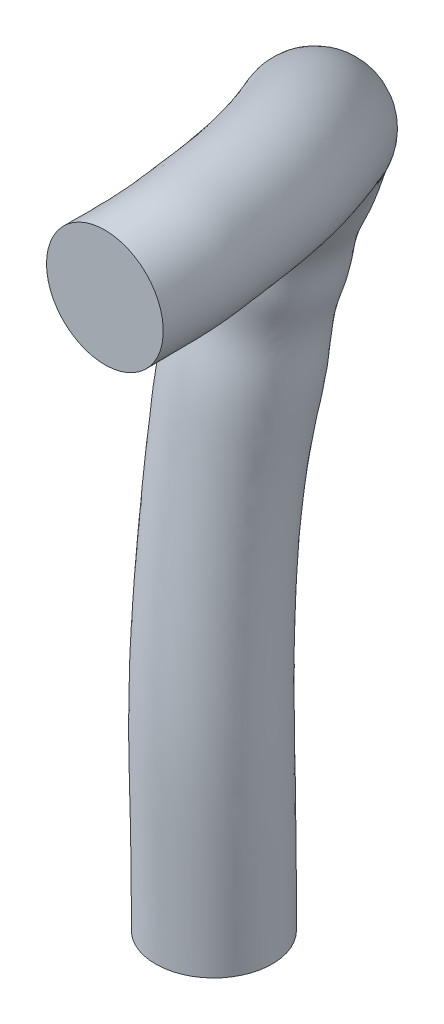
ISO-10303-21;
HEADER;
FILE_DESCRIPTION(('STEP AP214'),'2;1');
FILE_NAME('part.step','',(''),(''),'','','');
FILE_SCHEMA(('AUTOMOTIVE_DESIGN { 1 0 10303 214 1 1 1 1 }'));
ENDSEC;
DATA;
#1=APPLICATION_CONTEXT('core data for automotive mechanical design processes');
#2=APPLICATION_PROTOCOL_DEFINITION('international standard','automotive_design',2000,#1);
#3=PRODUCT_CONTEXT('',#1,'mechanical');
#4=PRODUCT('Part','Part','',(#3));
#5=PRODUCT_RELATED_PRODUCT_CATEGORY('part','',(#4));
#6=PRODUCT_DEFINITION_FORMATION('','',#4);
#7=PRODUCT_DEFINITION_CONTEXT('part definition',#1,'design');
#8=PRODUCT_DEFINITION('design','',#6,#7);
#9=PRODUCT_DEFINITION_SHAPE('','',#8);
#10=(LENGTH_UNIT() NAMED_UNIT(*) SI_UNIT(.MILLI.,.METRE.));
#11=(NAMED_UNIT(*) PLANE_ANGLE_UNIT() SI_UNIT($,.RADIAN.));
#12=(NAMED_UNIT(*) SI_UNIT($,.STERADIAN.) SOLID_ANGLE_UNIT());
#13=UNCERTAINTY_MEASURE_WITH_UNIT(LENGTH_MEASURE(1.E-05),#10,'distance_accuracy_value','');
#14=(GEOMETRIC_REPRESENTATION_CONTEXT(3) GLOBAL_UNCERTAINTY_ASSIGNED_CONTEXT((#13)) GLOBAL_UNIT_ASSIGNED_CONTEXT((#10,
#11,#12)) REPRESENTATION_CONTEXT('',''));
#15=CARTESIAN_POINT('',(0.,0.,0.));
#16=DIRECTION('',(0.,0.,1.));
#17=DIRECTION('',(1.,0.,0.));
#18=AXIS2_PLACEMENT_3D('',#15,#16,#17);
#19=CARTESIAN_POINT('',(-336.55,927.1,-338.85632));
#20=DIRECTION('',(0.,0.,-1.));
#21=DIRECTION('',(0.,-1.,0.));
#22=AXIS2_PLACEMENT_3D('',#19,#20,#21);
#23=PLANE('',#22);
#24=CARTESIAN_POINT('',(-336.55,927.1,-338.85632));
#25=DIRECTION('',(0.,0.,1.));
#26=DIRECTION('',(-0.546944138603988,0.837169104331223,0.));
#27=AXIS2_PLACEMENT_3D('',#24,#25,#26);
#28=CIRCLE('',#27,9.525);
#29=CARTESIAN_POINT('',(-341.759642920203,935.074035718755,-338.85632));
#30=VERTEX_POINT('',#29);
#31=EDGE_CURVE('E41',#30,#30,#28,.T.);
#32=ORIENTED_EDGE('',*,*,#31,.T.);
#33=EDGE_LOOP('',(#32));
#34=FACE_BOUND('',#33,.T.);
#35=ADVANCED_FACE('F33',(#34),#23,.F.);
#36=CARTESIAN_POINT('',(-370.740939999992,794.575500000011,-390.834879999985));
#37=DIRECTION('',(0.,1.,0.));
#38=DIRECTION('',(-1.,0.,0.));
#39=AXIS2_PLACEMENT_3D('',#36,#37,#38);
#40=PLANE('',#39);
#41=CARTESIAN_POINT('',(-370.740939999992,794.575500000011,-390.834879999985));
#42=DIRECTION('',(0.,-1.,0.));
#43=DIRECTION('',(-1.,0.,0.));
#44=AXIS2_PLACEMENT_3D('',#41,#42,#43);
#45=CIRCLE('',#44,9.52499999999996);
#46=CARTESIAN_POINT('',(-380.265939999992,794.575500000011,-390.834879999985));
#47=VERTEX_POINT('',#46);
#48=EDGE_CURVE('E10',#47,#47,#45,.T.);
#49=ORIENTED_EDGE('',*,*,#48,.T.);
#50=EDGE_LOOP('',(#49));
#51=FACE_BOUND('',#50,.T.);
#52=ADVANCED_FACE('F83',(#51),#40,.F.);
#53=CARTESIAN_POINT('',(-363.875846561977,794.575500000011,-384.232144423929));
#54=CARTESIAN_POINT('',(-363.875846561977,813.494487125589,-384.232144423929));
#55=CARTESIAN_POINT('',(-364.142477812169,826.543072637404,-383.884203964754));
#56=CARTESIAN_POINT('',(-365.43892785685,858.15359636656,-388.398999546555));
#57=CARTESIAN_POINT('',(-362.228331439262,877.176558179828,-393.33315585329));
#58=CARTESIAN_POINT('',(-360.825178694179,883.772837052275,-406.918336997418));
#59=CARTESIAN_POINT('',(-370.168532993468,896.388842718701,-410.098146877855));
#60=CARTESIAN_POINT('',(-364.791534219286,910.423752705118,-406.962201341084));
#61=CARTESIAN_POINT('',(-359.005182071554,919.28936800987,-401.644646519413));
#62=CARTESIAN_POINT('',(-353.04268762069,925.381572620677,-394.639029982038));
#63=CARTESIAN_POINT('',(-346.394330440372,930.611193828081,-384.623236621365));
#64=CARTESIAN_POINT('',(-340.169241583707,934.259595968167,-372.17092812119));
#65=CARTESIAN_POINT('',(-336.141143205497,936.242700496443,-352.923508258373));
#66=CARTESIAN_POINT('',(-335.539936275564,936.571293273496,-349.235045549637));
#67=CARTESIAN_POINT('',(-335.539936275564,936.571293273496,-338.85632));
#68=CARTESIAN_POINT('',(-364.058054005525,794.575500000011,-384.04269701828));
#69=CARTESIAN_POINT('',(-364.058054005525,813.494962976376,-384.04269701828));
#70=CARTESIAN_POINT('',(-364.321338442818,826.53140731676,-383.682490368678));
#71=CARTESIAN_POINT('',(-365.589978433164,858.187764176544,-388.20393458159));
#72=CARTESIAN_POINT('',(-362.346753878444,877.237841983857,-393.081553072442));
#73=CARTESIAN_POINT('',(-360.599604240086,883.766624345786,-406.653348799992));
#74=CARTESIAN_POINT('',(-369.913851290476,896.285905434293,-410.156313388854));
#75=CARTESIAN_POINT('',(-364.574253435235,910.319256297719,-407.060664458551));
#76=CARTESIAN_POINT('',(-358.792066401507,919.194740795188,-401.76818132861));
#77=CARTESIAN_POINT('',(-352.825506024652,925.303059391486,-394.764503223676));
#78=CARTESIAN_POINT('',(-346.165193021624,930.550619958902,-384.738159427502));
#79=CARTESIAN_POINT('',(-339.922656909605,934.216511465068,-372.257669482981));
#80=CARTESIAN_POINT('',(-335.88169340562,936.210137222335,-352.955324071846));
#81=CARTESIAN_POINT('',(-335.278568829513,936.543419806972,-349.259881184934));
#82=CARTESIAN_POINT('',(-335.278568829513,936.543419806972,-338.85632));
#83=CARTESIAN_POINT('',(-364.434421808419,794.575500000011,-383.682159154449));
#84=CARTESIAN_POINT('',(-364.434421808419,813.495348407488,-383.682159154449));
#85=CARTESIAN_POINT('',(-364.691939348121,826.507838651346,-383.297512257145));
#86=CARTESIAN_POINT('',(-365.905327975946,858.252268481178,-387.829305405729));
#87=CARTESIAN_POINT('',(-362.602308173534,877.35946015612,-392.592971113257));
#88=CARTESIAN_POINT('',(-360.17338657529,883.761932398954,-406.110756254147));
#89=CARTESIAN_POINT('',(-369.403969957824,896.081619830949,-410.249099232851));
#90=CARTESIAN_POINT('',(-364.139567488344,910.102780991475,-407.23676024951));
#91=CARTESIAN_POINT('',(-358.367592897617,918.992242749762,-401.997492628252));
#92=CARTESIAN_POINT('',(-352.394985669194,925.12958483654,-395.001282678477));
#93=CARTESIAN_POINT('',(-345.712601038936,930.410733848442,-384.957782805191));
#94=CARTESIAN_POINT('',(-339.436382819251,934.110363419539,-372.424832973385));
#95=CARTESIAN_POINT('',(-335.370201989204,936.124465452419,-353.016664328773));
#96=CARTESIAN_POINT('',(-334.763013932223,936.466977526842,-349.308313868497));
#97=CARTESIAN_POINT('',(-334.763013932223,936.466977526842,-338.85632));
#98=CARTESIAN_POINT('',(-365.03135498484,794.575500000011,-383.196490939595));
#99=CARTESIAN_POINT('',(-365.03135498484,813.494260247922,-383.196490939595));
#100=CARTESIAN_POINT('',(-365.282934134063,826.471946571246,-382.775590815188));
#101=CARTESIAN_POINT('',(-366.414829950331,858.337577711828,-387.314325523003));
#102=CARTESIAN_POINT('',(-363.038247029484,877.538442477659,-391.905183264417));
#103=CARTESIAN_POINT('',(-359.608580246851,883.777275192592,-405.263526602564));
#104=CARTESIAN_POINT('',(-368.640588870671,895.780961486469,-410.319679983601));
#105=CARTESIAN_POINT('',(-363.489683754225,909.757687092094,-407.439677985908));
#106=CARTESIAN_POINT('',(-357.738409562969,918.651381559457,-402.288809159446));
#107=CARTESIAN_POINT('',(-351.762793635226,924.822829029902,-395.314131189466));
#108=CARTESIAN_POINT('',(-345.052747352562,930.147547081319,-385.2564357266));
#109=CARTESIAN_POINT('',(-338.729704526453,933.894003174015,-372.656130803312));
#110=CARTESIAN_POINT('',(-334.627325633567,935.93706507243,-353.102498629935));
#111=CARTESIAN_POINT('',(-334.01340618597,936.292934259841,-349.375379379043));
#112=CARTESIAN_POINT('',(-334.01340618597,936.292934259841,-338.85632));
#113=CARTESIAN_POINT('',(-365.657192358033,794.575500000011,-382.766029044133));
#114=CARTESIAN_POINT('',(-365.657192358033,813.491556815287,-382.766029044133));
#115=CARTESIAN_POINT('',(-365.905476843968,826.435681480846,-382.309413576269));
#116=CARTESIAN_POINT('',(-366.957542074675,858.411487150723,-386.846771154726));
#117=CARTESIAN_POINT('',(-363.523272461877,877.713383095033,-391.263694769784));
#118=CARTESIAN_POINT('',(-359.118020525756,883.814179056576,-404.387463829391));
#119=CARTESIAN_POINT('',(-367.881643387165,895.487076360433,-410.32370595832));
#120=CARTESIAN_POINT('',(-362.844463528909,909.394278788281,-407.582635739603));
#121=CARTESIAN_POINT('',(-357.119006562084,918.276022972674,-402.528097644739));
#122=CARTESIAN_POINT('',(-351.14625008985,924.472329564608,-395.584847524689));
#123=CARTESIAN_POINT('',(-344.413913677084,929.833860227586,-385.524151041061));
#124=CARTESIAN_POINT('',(-338.047806145576,933.623303692037,-372.867774088236));
#125=CARTESIAN_POINT('',(-333.910946265888,935.693514907318,-353.181818663902));
#126=CARTESIAN_POINT('',(-333.289707654644,936.062217340463,-349.437225296379));
#127=CARTESIAN_POINT('',(-333.289707654644,936.062217340463,-338.85632));
#128=CARTESIAN_POINT('',(-369.564778125985,794.575500000011,-380.514902018702));
#129=CARTESIAN_POINT('',(-369.564778125985,813.466405433784,-380.514902018702));
#130=CARTESIAN_POINT('',(-369.808747623031,826.216630452866,-379.848006234895));
#131=CARTESIAN_POINT('',(-370.393470658995,858.78684718221,-384.328767812612));
#132=CARTESIAN_POINT('',(-366.706819493678,878.735192588011,-387.699845537147));
#133=CARTESIAN_POINT('',(-356.618500474763,884.160051807726,-398.985134606121));
#134=CARTESIAN_POINT('',(-363.37255225895,893.770423709888,-409.960792960402));
#135=CARTESIAN_POINT('',(-359.016233165324,907.116341783373,-408.088217384858));
#136=CARTESIAN_POINT('',(-353.474791034827,915.832587419012,-403.655397417965));
#137=CARTESIAN_POINT('',(-347.553239685383,922.123672716435,-396.957472622514));
#138=CARTESIAN_POINT('',(-340.718946029013,927.665883673389,-386.943938156198));
#139=CARTESIAN_POINT('',(-334.11737774697,931.689865026476,-374.018084956403));
#140=CARTESIAN_POINT('',(-329.784469301397,933.911772845741,-353.618013038122));
#141=CARTESIAN_POINT('',(-329.116079447723,934.354111076519,-349.776175568566));
#142=CARTESIAN_POINT('',(-329.116079447723,934.354111076519,-338.85632));
#143=CARTESIAN_POINT('',(-374.312517085676,794.575500000011,-381.054467465187));
#144=CARTESIAN_POINT('',(-374.312517085676,813.361599723884,-381.054467465187));
#145=CARTESIAN_POINT('',(-374.673178142008,826.011711079975,-380.227476364194));
#146=CARTESIAN_POINT('',(-374.923366390826,858.596518397306,-384.279452786801));
#147=CARTESIAN_POINT('',(-371.738665615061,879.44813163321,-386.6810480973));
#148=CARTESIAN_POINT('',(-357.807701153077,885.446257225217,-392.928379849387));
#149=CARTESIAN_POINT('',(-359.616103081324,892.572024288783,-406.609159576154));
#150=CARTESIAN_POINT('',(-355.867906349279,904.281888724747,-405.799577914562));
#151=CARTESIAN_POINT('',(-350.721196746988,912.115351743268,-402.274064789705));
#152=CARTESIAN_POINT('',(-345.112022146781,918.068274272769,-396.242417373719));
#153=CARTESIAN_POINT('',(-338.433009558086,923.461203370457,-386.78077700164));
#154=CARTESIAN_POINT('',(-331.796073237616,927.516131019332,-374.13031230384));
#155=CARTESIAN_POINT('',(-327.369301738105,929.788705025014,-353.711235453028));
#156=CARTESIAN_POINT('',(-326.632731262108,930.271815412385,-349.820479424925));
#157=CARTESIAN_POINT('',(-326.632731262108,930.271815412385,-338.85632));
#158=CARTESIAN_POINT('',(-381.132623689013,794.575500000011,-387.613935432948));
#159=CARTESIAN_POINT('',(-381.132623689013,813.131577020057,-387.613935432948));
#160=CARTESIAN_POINT('',(-381.876294869343,825.800622995147,-386.725475047013));
#161=CARTESIAN_POINT('',(-382.058003446125,857.183324692249,-389.525567993976));
#162=CARTESIAN_POINT('',(-381.022644981808,879.538229951214,-391.066587411424));
#163=CARTESIAN_POINT('',(-366.980968655411,888.823635217389,-385.123625870285));
#164=CARTESIAN_POINT('',(-357.261914948152,892.417903398694,-396.653135207719));
#165=CARTESIAN_POINT('',(-354.000219597394,900.092312222862,-397.384284986249));
#166=CARTESIAN_POINT('',(-349.722864876701,905.453509410003,-395.430380030142));
#167=CARTESIAN_POINT('',(-345.004301546448,910.119926026257,-391.006515395318));
#168=CARTESIAN_POINT('',(-339.041453714237,914.64695165494,-383.209975120029));
#169=CARTESIAN_POINT('',(-332.796576672215,918.29763848496,-372.028838732515));
#170=CARTESIAN_POINT('',(-328.489926478525,920.406923498248,-353.044922210753));
#171=CARTESIAN_POINT('',(-327.636176056998,920.862587354538,-349.2968446959));
#172=CARTESIAN_POINT('',(-327.636176056998,920.862587354538,-338.85632));
#173=CARTESIAN_POINT('',(-381.250182308986,794.575500000011,-393.648667463076));
#174=CARTESIAN_POINT('',(-381.250182308986,812.998174684243,-393.648667463076));
#175=CARTESIAN_POINT('',(-382.220950377274,825.905383354459,-392.931653957796));
#176=CARTESIAN_POINT('',(-382.823336579002,855.990272367354,-395.059138931047));
#177=CARTESIAN_POINT('',(-383.287217055104,878.583937547873,-397.130035530821));
#178=CARTESIAN_POINT('',(-374.781242158967,890.447800046798,-385.906097447789));
#179=CARTESIAN_POINT('',(-360.335465242944,894.019836356626,-391.21809694673));
#180=CARTESIAN_POINT('',(-356.685905737772,899.899398007129,-391.989833458713));
#181=CARTESIAN_POINT('',(-352.73303452277,903.985254040344,-390.337785921258));
#182=CARTESIAN_POINT('',(-348.48219340453,907.80975344087,-386.607252991341));
#183=CARTESIAN_POINT('',(-343.036497224882,911.654931859011,-379.734782527574));
#184=CARTESIAN_POINT('',(-337.251754026326,914.839306634214,-369.662368330795));
#185=CARTESIAN_POINT('',(-333.208180434233,916.704103625166,-352.265040339124));
#186=CARTESIAN_POINT('',(-332.332714803409,917.071237396009,-348.577148554679));
#187=CARTESIAN_POINT('',(-332.332714803409,917.071237396009,-338.85632));
#188=CARTESIAN_POINT('',(-373.961884567028,794.575500000011,-401.226563689006));
#189=CARTESIAN_POINT('',(-373.961884567028,812.981060168414,-401.226563689006));
#190=CARTESIAN_POINT('',(-375.066525151303,826.371072194808,-401.00019754034));
#191=CARTESIAN_POINT('',(-376.781313526436,854.623634026356,-402.861738183335));
#192=CARTESIAN_POINT('',(-378.550319487853,876.132571106372,-407.194145948691));
#193=CARTESIAN_POINT('',(-383.804220322682,890.696312555326,-396.505629441342));
#194=CARTESIAN_POINT('',(-370.52273336266,898.1373270894,-388.891423930349));
#195=CARTESIAN_POINT('',(-365.377137099817,904.079254434146,-388.051335099304));
#196=CARTESIAN_POINT('',(-361.257661324647,907.77034259295,-385.396296124458));
#197=CARTESIAN_POINT('',(-357.16945724602,910.95028261761,-381.588686893382));
#198=CARTESIAN_POINT('',(-352.201993974785,914.077886621573,-375.136069798063));
#199=CARTESIAN_POINT('',(-347.115140990379,916.562686759692,-366.20542628566));
#200=CARTESIAN_POINT('',(-343.586172429312,918.006634589025,-350.945789701563));
#201=CARTESIAN_POINT('',(-342.787412645462,918.186176056998,-347.684124199891));
#202=CARTESIAN_POINT('',(-342.787412645462,918.186176056998,-338.85632));
#203=CARTESIAN_POINT('',(-367.927152536901,794.575500000011,-401.344122308979));
#204=CARTESIAN_POINT('',(-367.927152536901,813.097347988399,-401.344122308979));
#205=CARTESIAN_POINT('',(-368.913383737486,826.645941958676,-401.344653141586));
#206=CARTESIAN_POINT('',(-371.110623969332,854.707025123831,-403.662887161426));
#207=CARTESIAN_POINT('',(-372.439987358653,875.096688812927,-409.301480448518));
#208=CARTESIAN_POINT('',(-383.32946072663,889.273901237638,-404.328626676094));
#209=CARTESIAN_POINT('',(-375.719952755704,899.878275475063,-392.437519832297));
#210=CARTESIAN_POINT('',(-369.747628538592,907.665681728195,-390.248181395111));
#211=CARTESIAN_POINT('',(-365.168407484909,912.311609872306,-386.477190263519));
#212=CARTESIAN_POINT('',(-360.744521843591,915.810166573884,-381.912901757532));
#213=CARTESIAN_POINT('',(-355.648171388358,919.037038395228,-374.880703660602));
#214=CARTESIAN_POINT('',(-350.667782902732,921.420184697843,-365.744026383751));
#215=CARTESIAN_POINT('',(-347.29353175921,922.766944408793,-350.732613785325));
#216=CARTESIAN_POINT('',(-346.578762603991,922.882714803409,-347.510795986323));
#217=CARTESIAN_POINT('',(-346.578762603991,922.882714803409,-338.85632));
#218=CARTESIAN_POINT('',(-361.107045933563,794.575500000011,-394.784654341217));
#219=CARTESIAN_POINT('',(-361.107045933563,813.326555347465,-394.784654341217));
#220=CARTESIAN_POINT('',(-361.710267010152,826.857422520991,-394.846654569562));
#221=CARTESIAN_POINT('',(-363.975986914033,856.12018737142,-398.416771676237));
#222=CARTESIAN_POINT('',(-363.156007991905,875.006596560724,-404.915941481461));
#223=CARTESIAN_POINT('',(-374.156193224297,885.896521440652,-412.133378912942));
#224=CARTESIAN_POINT('',(-378.074140888877,900.032396638516,-402.393549549487));
#225=CARTESIAN_POINT('',(-371.615315290477,911.85525817441,-398.663463121345));
#226=CARTESIAN_POINT('',(-366.166739355197,918.973452220299,-393.320916459618));
#227=CARTESIAN_POINT('',(-360.852242443924,923.758514816527,-387.148649110618));
#228=CARTESIAN_POINT('',(-355.039727232208,927.851290112703,-378.452271288253));
#229=CARTESIAN_POINT('',(-349.667279468133,930.638677231568,-367.840093358808));
#230=CARTESIAN_POINT('',(-346.17290701879,932.148725935744,-351.418753709667));
#231=CARTESIAN_POINT('',(-345.575317809101,932.291942861257,-347.991730135602));
#232=CARTESIAN_POINT('',(-345.575317809101,932.291942861257,-338.85632));
#233=CARTESIAN_POINT('',(-360.382984892778,794.575500000011,-390.061531252664));
#234=CARTESIAN_POINT('',(-360.382984892778,813.442305885082,-390.061531252664));
#235=CARTESIAN_POINT('',(-360.795606907177,826.804527015982,-390.012753066261));
#236=CARTESIAN_POINT('',(-362.781733550676,857.065059052122,-394.158476923425));
#237=CARTESIAN_POINT('',(-360.739278708538,875.64698146527,-400.378607035243));
#238=CARTESIAN_POINT('',(-367.98564308888,884.4731221011,-412.338413396426));
#239=CARTESIAN_POINT('',(-376.206466678774,898.957636978338,-407.029668284324));
#240=CARTESIAN_POINT('',(-369.965441352698,912.382122292462,-403.126464627447));
#241=CARTESIAN_POINT('',(-364.21411089473,920.601039809969,-397.430240288413));
#242=CARTESIAN_POINT('',(-358.497449592682,926.080109524701,-390.634605254979));
#243=CARTESIAN_POINT('',(-352.265633474665,930.718320672445,-381.152863263289));
#244=CARTESIAN_POINT('',(-346.543266876292,933.860978298727,-369.646222211012));
#245=CARTESIAN_POINT('',(-342.858657547869,935.552700592882,-352.017663270267));
#246=CARTESIAN_POINT('',(-342.286901675357,935.758710149631,-348.518387347715));
#247=CARTESIAN_POINT('',(-342.286901675357,935.758710149631,-338.85632));
#248=CARTESIAN_POINT('',(-362.480219602954,794.575500000011,-386.06923792815));
#249=CARTESIAN_POINT('',(-362.480219602954,813.483214072288,-386.06923792815));
#250=CARTESIAN_POINT('',(-362.786859187844,826.639100298827,-385.82649601654));
#251=CARTESIAN_POINT('',(-364.32382110125,857.815734742003,-390.247927903653));
#252=CARTESIAN_POINT('',(-361.458456362485,876.644837760915,-395.650646081014));
#253=CARTESIAN_POINT('',(-363.05114137382,883.922503834068,-409.00780342413));
#254=CARTESIAN_POINT('',(-372.322278829198,897.281892996218,-409.309513768366));
#255=CARTESIAN_POINT('',(-366.632975774552,911.216280306298,-405.865830160071));
#256=CARTESIAN_POINT('',(-360.834895793786,919.925945046268,-400.374144473301));
#257=CARTESIAN_POINT('',(-354.933032891232,925.841287852779,-393.397084840518));
#258=CARTESIAN_POINT('',(-348.409158450575,930.890027463809,-383.52039743952));
#259=CARTESIAN_POINT('',(-342.34726162435,934.37452597933,-371.35504755035));
#260=CARTESIAN_POINT('',(-338.43471834383,936.261288828307,-352.628186272256));
#261=CARTESIAN_POINT('',(-337.846915850952,936.548219679412,-349.001802652124));
#262=CARTESIAN_POINT('',(-337.846915850952,936.548219679412,-338.85632));
#263=CARTESIAN_POINT('',(-362.885981118186,794.575500000011,-385.427110640233));
#264=CARTESIAN_POINT('',(-362.885981118186,813.488627595127,-385.427110640233));
#265=CARTESIAN_POINT('',(-363.176966807513,826.609312471468,-385.150636915818));
#266=CARTESIAN_POINT('',(-364.636307884187,857.93527287277,-389.611088312375));
#267=CARTESIAN_POINT('',(-361.643900007779,876.81686585801,-394.867642001555));
#268=CARTESIAN_POINT('',(-362.264572391682,883.850425695427,-408.383589817813));
#269=CARTESIAN_POINT('',(-371.639299896267,896.992980915504,-409.63480743026));
#270=CARTESIAN_POINT('',(-366.048023340962,910.988064165913,-406.280338557741));
#271=CARTESIAN_POINT('',(-360.247707647546,919.765555325343,-400.834268823368));
#272=CARTESIAN_POINT('',(-354.31996534776,925.747271120664,-393.836759931258));
#273=CARTESIAN_POINT('',(-347.750691083502,930.860764902837,-383.903322503663));
#274=CARTESIAN_POINT('',(-341.633078315309,934.401295111169,-371.634610817676));
#275=CARTESIAN_POINT('',(-337.682177891648,936.320476397034,-352.728610581395));
#276=CARTESIAN_POINT('',(-337.090837477639,936.621126157441,-349.081400105271));
#277=CARTESIAN_POINT('',(-337.090837477639,936.621126157441,-338.85632));
#278=CARTESIAN_POINT('',(-363.348032768784,794.575500000011,-384.811715560459));
#279=CARTESIAN_POINT('',(-363.348032768784,813.492493302771,-384.811715560459));
#280=CARTESIAN_POINT('',(-363.625505260826,826.577400281625,-384.50020428825));
#281=CARTESIAN_POINT('',(-365.004707851203,858.048546506841,-388.992355798833));
#282=CARTESIAN_POINT('',(-361.896229226003,876.994063290669,-394.093121159352));
#283=CARTESIAN_POINT('',(-361.518345978566,883.798974842905,-407.690715122794));
#284=CARTESIAN_POINT('',(-370.922477683622,896.695370490453,-409.902288820144));
#285=CARTESIAN_POINT('',(-365.435076923737,910.725827719126,-406.649686010351));
#286=CARTESIAN_POINT('',(-359.638268362921,919.556445654639,-401.260932722207));
#287=CARTESIAN_POINT('',(-353.689903708488,925.597710122656,-394.253160821441));
#288=CARTESIAN_POINT('',(-347.078804172293,930.771897949594,-384.272586738367));
#289=CARTESIAN_POINT('',(-340.906613025371,934.367249367941,-371.90753016135));
#290=CARTESIAN_POINT('',(-336.917138894918,936.318619891977,-352.827400412182));
#291=CARTESIAN_POINT('',(-336.321384562845,936.633169576625,-349.159300056714));
#292=CARTESIAN_POINT('',(-336.321384562845,936.633169576625,-338.85632));
#293=CARTESIAN_POINT('',(-363.693639118428,794.575500000011,-384.421591829577));
#294=CARTESIAN_POINT('',(-363.693639118428,813.494011274803,-384.421591829577));
#295=CARTESIAN_POINT('',(-363.96361718152,826.554737958049,-384.085917560831));
#296=CARTESIAN_POINT('',(-365.287877280536,858.119428556576,-388.59406451152));
#297=CARTESIAN_POINT('',(-362.109909000081,877.115274375799,-393.584758634138));
#298=CARTESIAN_POINT('',(-361.050753148272,883.779049758764,-407.183325194843));
#299=CARTESIAN_POINT('',(-370.423214696461,896.49178000311,-410.039980366856));
#300=CARTESIAN_POINT('',(-365.008815003337,910.528249112517,-406.863738223618));
#301=CARTESIAN_POINT('',(-359.218297741601,919.383995224552,-401.521111710216));
#302=CARTESIAN_POINT('',(-353.259869216727,925.460085849868,-394.5135567404));
#303=CARTESIAN_POINT('',(-346.623467859119,930.67176769726,-384.508313815228));
#304=CARTESIAN_POINT('',(-340.415826257808,934.302680471265,-372.0841867594));
#305=CARTESIAN_POINT('',(-336.400593005374,936.275263770551,-352.8916924449));
#306=CARTESIAN_POINT('',(-335.801303721616,936.599166740021,-349.21020991434));
#307=CARTESIAN_POINT('',(-335.801303721616,936.599166740021,-338.85632));
#308=CARTESIAN_POINT('',(-363.875846561977,794.575500000011,-384.232144423929));
#309=CARTESIAN_POINT('',(-363.875846561977,813.494487125589,-384.232144423929));
#310=CARTESIAN_POINT('',(-364.142477812169,826.543072637404,-383.884203964754));
#311=CARTESIAN_POINT('',(-365.43892785685,858.15359636656,-388.398999546555));
#312=CARTESIAN_POINT('',(-362.228331439262,877.176558179828,-393.33315585329));
#313=CARTESIAN_POINT('',(-360.825178694179,883.772837052275,-406.918336997418));
#314=CARTESIAN_POINT('',(-370.168532993468,896.388842718701,-410.098146877855));
#315=CARTESIAN_POINT('',(-364.791534219286,910.423752705118,-406.962201341084));
#316=CARTESIAN_POINT('',(-359.005182071554,919.28936800987,-401.644646519413));
#317=CARTESIAN_POINT('',(-353.04268762069,925.381572620677,-394.639029982038));
#318=CARTESIAN_POINT('',(-346.394330440372,930.611193828081,-384.623236621365));
#319=CARTESIAN_POINT('',(-340.169241583707,934.259595968167,-372.17092812119));
#320=CARTESIAN_POINT('',(-336.141143205497,936.242700496443,-352.923508258373));
#321=CARTESIAN_POINT('',(-335.539936275564,936.571293273496,-349.235045549637));
#322=CARTESIAN_POINT('',(-335.539936275564,936.571293273496,-338.85632));
#323=B_SPLINE_SURFACE_WITH_KNOTS('',3,3,((#53,#54,#55,#56,#57,#58,#59,#60,#61,#62,#63,#64,#65,
#66,#67),(#68,#69,#70,#71,#72,#73,#74,#75,#76,#77,#78,#79,#80,#81,#82),(#83,#84,#85,#86,#87,#88,
#89,#90,#91,#92,#93,#94,#95,#96,#97),(#98,#99,#100,#101,#102,#103,#104,#105,#106,#107,#108,#109,
#110,#111,#112),(#113,#114,#115,#116,#117,#118,#119,#120,#121,#122,#123,#124,#125,#126,#127),
(#128,#129,#130,#131,#132,#133,#134,#135,#136,#137,#138,#139,#140,#141,#142),(#143,#144,#145,
#146,#147,#148,#149,#150,#151,#152,#153,#154,#155,#156,#157),(#158,#159,#160,#161,#162,#163,
#164,#165,#166,#167,#168,#169,#170,#171,#172),(#173,#174,#175,#176,#177,#178,#179,#180,#181,
#182,#183,#184,#185,#186,#187),(#188,#189,#190,#191,#192,#193,#194,#195,#196,#197,#198,#199,
#200,#201,#202),(#203,#204,#205,#206,#207,#208,#209,#210,#211,#212,#213,#214,#215,#216,#217),
(#218,#219,#220,#221,#222,#223,#224,#225,#226,#227,#228,#229,#230,#231,#232),(#233,#234,#235,
#236,#237,#238,#239,#240,#241,#242,#243,#244,#245,#246,#247),(#248,#249,#250,#251,#252,#253,
#254,#255,#256,#257,#258,#259,#260,#261,#262),(#263,#264,#265,#266,#267,#268,#269,#270,#271,
#272,#273,#274,#275,#276,#277),(#278,#279,#280,#281,#282,#283,#284,#285,#286,#287,#288,#289,
#290,#291,#292),(#293,#294,#295,#296,#297,#298,#299,#300,#301,#302,#303,#304,#305,#306,#307),
(#308,#309,#310,#311,#312,#313,#314,#315,#316,#317,#318,#319,#320,#321,#322)),.UNSPECIFIED.,.T.,
.F.,.F.,(4,1,1,1,1,2,2,2,1,1,1,1,4),(4,1,1,1,1,1,1,1,1,1,1,1,4),(0.,0.0125,0.0249999999999999,
0.0375000000000001,0.05,0.25,0.5,0.75,0.95,0.9625,0.975,0.9875,1.),(0.,0.180740314038915,
0.361426285290838,0.422863687724523,0.50038728112685,0.577629025770167,0.623899099093263,
0.669151315843759,0.714326155940481,0.759484959211556,0.839608910317355,0.91976256033915,1.),.UNSPECIFIED.);
#324=ORIENTED_EDGE('',*,*,#48,.F.);
#325=EDGE_LOOP('',(#324));
#326=FACE_BOUND('',#325,.T.);
#327=ORIENTED_EDGE('',*,*,#31,.F.);
#328=EDGE_LOOP('',(#327));
#329=FACE_BOUND('',#328,.T.);
#330=ADVANCED_FACE('F66',(#326,#329),#323,.F.);
#331=CLOSED_SHELL('',(#35,#52,#330));
#332=MANIFOLD_SOLID_BREP('B2',#331);
#333=ADVANCED_BREP_SHAPE_REPRESENTATION('',(#18,#332),#14);
#334=SHAPE_DEFINITION_REPRESENTATION(#9,#333);
ENDSEC;
END-ISO-10303-21;
